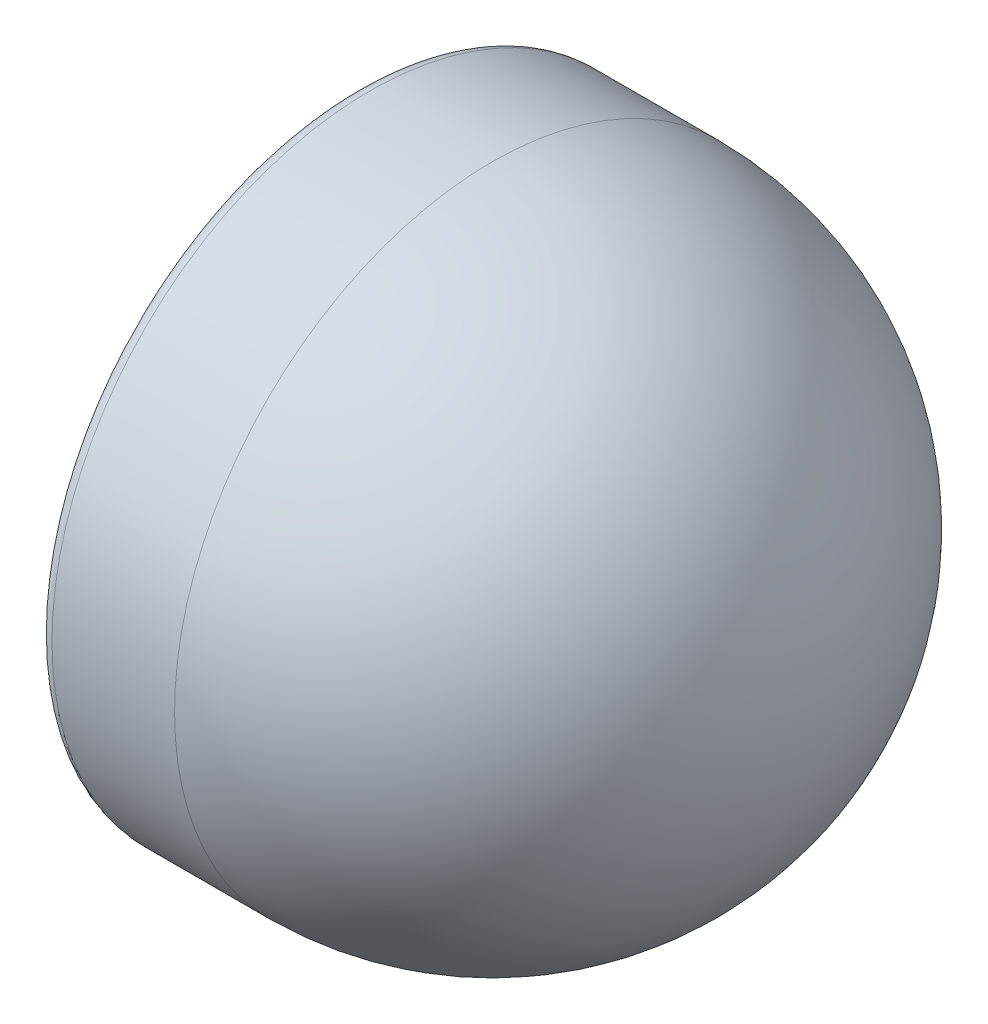
ISO-10303-21;
HEADER;
FILE_DESCRIPTION(('STEP AP214'),'2;1');
FILE_NAME('part.step','',(''),(''),'','','');
FILE_SCHEMA(('AUTOMOTIVE_DESIGN { 1 0 10303 214 1 1 1 1 }'));
ENDSEC;
DATA;
#1=APPLICATION_CONTEXT('core data for automotive mechanical design processes');
#2=APPLICATION_PROTOCOL_DEFINITION('international standard','automotive_design',2000,#1);
#3=PRODUCT_CONTEXT('',#1,'mechanical');
#4=PRODUCT('Part','Part','',(#3));
#5=PRODUCT_RELATED_PRODUCT_CATEGORY('part','',(#4));
#6=PRODUCT_DEFINITION_FORMATION('','',#4);
#7=PRODUCT_DEFINITION_CONTEXT('part definition',#1,'design');
#8=PRODUCT_DEFINITION('design','',#6,#7);
#9=PRODUCT_DEFINITION_SHAPE('','',#8);
#10=(LENGTH_UNIT() NAMED_UNIT(*) SI_UNIT(.MILLI.,.METRE.));
#11=(NAMED_UNIT(*) PLANE_ANGLE_UNIT() SI_UNIT($,.RADIAN.));
#12=(NAMED_UNIT(*) SI_UNIT($,.STERADIAN.) SOLID_ANGLE_UNIT());
#13=UNCERTAINTY_MEASURE_WITH_UNIT(LENGTH_MEASURE(1.E-05),#10,'distance_accuracy_value','');
#14=(GEOMETRIC_REPRESENTATION_CONTEXT(3) GLOBAL_UNCERTAINTY_ASSIGNED_CONTEXT((#13)) GLOBAL_UNIT_ASSIGNED_CONTEXT((#10,
#11,#12)) REPRESENTATION_CONTEXT('',''));
#15=CARTESIAN_POINT('',(0.,0.,0.));
#16=DIRECTION('',(0.,0.,1.));
#17=DIRECTION('',(1.,0.,0.));
#18=AXIS2_PLACEMENT_3D('',#15,#16,#17);
#19=CARTESIAN_POINT('',(-70.,0.,0.));
#20=DIRECTION('',(-1.,0.,0.));
#21=DIRECTION('',(0.,1.,0.));
#22=AXIS2_PLACEMENT_3D('',#19,#20,#21);
#23=SPHERICAL_SURFACE('',#22,70.);
#24=CARTESIAN_POINT('',(-70.,0.,0.));
#25=DIRECTION('',(-1.,0.,0.));
#26=DIRECTION('',(0.,0.,1.));
#27=AXIS2_PLACEMENT_3D('',#24,#25,#26);
#28=CIRCLE('',#27,70.);
#29=CARTESIAN_POINT('',(-70.,0.,70.));
#30=VERTEX_POINT('',#29);
#31=EDGE_CURVE('E10',#30,#30,#28,.T.);
#32=ORIENTED_EDGE('',*,*,#31,.F.);
#33=EDGE_LOOP('',(#32));
#34=FACE_BOUND('',#33,.T.);
#35=ADVANCED_FACE('F37',(#34),#23,.T.);
#36=CARTESIAN_POINT('',(-1.,0.,0.));
#37=DIRECTION('',(-1.,0.,0.));
#38=DIRECTION('',(0.,0.,1.));
#39=AXIS2_PLACEMENT_3D('',#36,#37,#38);
#40=CYLINDRICAL_SURFACE('',#39,70.);
#41=CARTESIAN_POINT('',(-97.,0.,0.));
#42=DIRECTION('',(-1.,0.,0.));
#43=DIRECTION('',(0.,0.,1.));
#44=AXIS2_PLACEMENT_3D('',#41,#42,#43);
#45=CIRCLE('',#44,70.);
#46=CARTESIAN_POINT('',(-97.,0.,70.));
#47=VERTEX_POINT('',#46);
#48=EDGE_CURVE('E44',#47,#47,#45,.T.);
#49=ORIENTED_EDGE('',*,*,#48,.F.);
#50=EDGE_LOOP('',(#49));
#51=FACE_BOUND('',#50,.T.);
#52=ORIENTED_EDGE('',*,*,#31,.T.);
#53=EDGE_LOOP('',(#52));
#54=FACE_BOUND('',#53,.T.);
#55=ADVANCED_FACE('F201',(#51,#54),#40,.T.);
#56=CARTESIAN_POINT('',(-97.,0.,0.));
#57=DIRECTION('',(-1.,0.,0.));
#58=DIRECTION('',(0.,0.,1.));
#59=AXIS2_PLACEMENT_3D('',#56,#57,#58);
#60=TOROIDAL_SURFACE('',#59,67.,3.);
#61=CARTESIAN_POINT('',(-100.,0.,0.));
#62=DIRECTION('',(-1.,0.,0.));
#63=DIRECTION('',(0.,0.,1.));
#64=AXIS2_PLACEMENT_3D('',#61,#62,#63);
#65=CIRCLE('',#64,67.);
#66=CARTESIAN_POINT('',(-100.,0.,67.));
#67=VERTEX_POINT('',#66);
#68=EDGE_CURVE('E49',#67,#67,#65,.T.);
#69=ORIENTED_EDGE('',*,*,#68,.F.);
#70=EDGE_LOOP('',(#69));
#71=FACE_BOUND('',#70,.T.);
#72=ORIENTED_EDGE('',*,*,#48,.T.);
#73=EDGE_LOOP('',(#72));
#74=FACE_BOUND('',#73,.T.);
#75=ADVANCED_FACE('F196',(#71,#74),#60,.T.);
#76=CARTESIAN_POINT('',(-100.,67.,0.));
#77=DIRECTION('',(1.,0.,0.));
#78=DIRECTION('',(0.,0.,-1.));
#79=AXIS2_PLACEMENT_3D('',#76,#77,#78);
#80=PLANE('',#79);
#81=CARTESIAN_POINT('',(-100.,0.,0.));
#82=DIRECTION('',(-1.,0.,0.));
#83=DIRECTION('',(0.,0.,1.));
#84=AXIS2_PLACEMENT_3D('',#81,#82,#83);
#85=CIRCLE('',#84,61.5);
#86=CARTESIAN_POINT('',(-100.,0.,61.5));
#87=VERTEX_POINT('',#86);
#88=EDGE_CURVE('E54',#87,#87,#85,.T.);
#89=ORIENTED_EDGE('',*,*,#88,.F.);
#90=EDGE_LOOP('',(#89));
#91=FACE_BOUND('',#90,.T.);
#92=ORIENTED_EDGE('',*,*,#68,.T.);
#93=EDGE_LOOP('',(#92));
#94=FACE_BOUND('',#93,.T.);
#95=ADVANCED_FACE('F190',(#91,#94),#80,.F.);
#96=CARTESIAN_POINT('',(-98.5,0.,0.));
#97=DIRECTION('',(-1.,0.,0.));
#98=DIRECTION('',(0.,0.,1.));
#99=AXIS2_PLACEMENT_3D('',#96,#97,#98);
#100=TOROIDAL_SURFACE('',#99,61.5,1.5);
#101=CARTESIAN_POINT('',(-98.5,0.,0.));
#102=DIRECTION('',(-1.,0.,0.));
#103=DIRECTION('',(0.,0.,1.));
#104=AXIS2_PLACEMENT_3D('',#101,#102,#103);
#105=CIRCLE('',#104,60.);
#106=CARTESIAN_POINT('',(-98.5,0.,60.));
#107=VERTEX_POINT('',#106);
#108=EDGE_CURVE('E60',#107,#107,#105,.T.);
#109=ORIENTED_EDGE('',*,*,#108,.F.);
#110=EDGE_LOOP('',(#109));
#111=FACE_BOUND('',#110,.T.);
#112=ORIENTED_EDGE('',*,*,#88,.T.);
#113=EDGE_LOOP('',(#112));
#114=FACE_BOUND('',#113,.T.);
#115=ADVANCED_FACE('F184',(#111,#114),#100,.T.);
#116=CARTESIAN_POINT('',(-1.,0.,0.));
#117=DIRECTION('',(-1.,0.,0.));
#118=DIRECTION('',(0.,0.,1.));
#119=AXIS2_PLACEMENT_3D('',#116,#117,#118);
#120=CYLINDRICAL_SURFACE('',#119,60.);
#121=CARTESIAN_POINT('',(-96.6213203435597,0.,0.));
#122=DIRECTION('',(-1.,0.,0.));
#123=DIRECTION('',(0.,0.,1.));
#124=AXIS2_PLACEMENT_3D('',#121,#122,#123);
#125=CIRCLE('',#124,60.);
#126=CARTESIAN_POINT('',(-96.6213203435597,0.,60.));
#127=VERTEX_POINT('',#126);
#128=EDGE_CURVE('E64',#127,#127,#125,.T.);
#129=ORIENTED_EDGE('',*,*,#128,.F.);
#130=EDGE_LOOP('',(#129));
#131=FACE_BOUND('',#130,.T.);
#132=ORIENTED_EDGE('',*,*,#108,.T.);
#133=EDGE_LOOP('',(#132));
#134=FACE_BOUND('',#133,.T.);
#135=ADVANCED_FACE('F178',(#131,#134),#120,.F.);
#136=CARTESIAN_POINT('',(-96.6213203435597,0.,0.));
#137=DIRECTION('',(-1.,0.,0.));
#138=DIRECTION('',(0.,0.,1.));
#139=AXIS2_PLACEMENT_3D('',#136,#137,#138);
#140=TOROIDAL_SURFACE('',#139,61.5,1.5);
#141=CARTESIAN_POINT('',(-95.5606601717798,0.,0.));
#142=DIRECTION('',(-1.,0.,0.));
#143=DIRECTION('',(0.,0.,1.));
#144=AXIS2_PLACEMENT_3D('',#141,#142,#143);
#145=CIRCLE('',#144,60.4393398282202);
#146=CARTESIAN_POINT('',(-95.5606601717798,0.,60.4393398282202));
#147=VERTEX_POINT('',#146);
#148=EDGE_CURVE('E68',#147,#147,#145,.T.);
#149=ORIENTED_EDGE('',*,*,#148,.F.);
#150=EDGE_LOOP('',(#149));
#151=FACE_BOUND('',#150,.T.);
#152=ORIENTED_EDGE('',*,*,#128,.T.);
#153=EDGE_LOOP('',(#152));
#154=FACE_BOUND('',#153,.T.);
#155=ADVANCED_FACE('F172',(#151,#154),#140,.T.);
#156=CARTESIAN_POINT('',(-95.5606601717798,0.,0.));
#157=DIRECTION('',(1.,0.,0.));
#158=DIRECTION('',(0.,0.,-1.));
#159=AXIS2_PLACEMENT_3D('',#156,#157,#158);
#160=CONICAL_SURFACE('',#159,60.4393398282202,0.785398163397447);
#161=CARTESIAN_POINT('',(-92.0009060725429,0.,0.));
#162=DIRECTION('',(-1.,0.,0.));
#163=DIRECTION('',(0.,0.,1.));
#164=AXIS2_PLACEMENT_3D('',#161,#162,#163);
#165=CIRCLE('',#164,63.9990939274571);
#166=CARTESIAN_POINT('',(-92.0009060725429,0.,63.9990939274571));
#167=VERTEX_POINT('',#166);
#168=EDGE_CURVE('E72',#167,#167,#165,.T.);
#169=ORIENTED_EDGE('',*,*,#168,.F.);
#170=EDGE_LOOP('',(#169));
#171=FACE_BOUND('',#170,.T.);
#172=ORIENTED_EDGE('',*,*,#148,.T.);
#173=EDGE_LOOP('',(#172));
#174=FACE_BOUND('',#173,.T.);
#175=ADVANCED_FACE('F166',(#171,#174),#160,.F.);
#176=CARTESIAN_POINT('',(-92.0009060725429,63.9990939274571,0.));
#177=DIRECTION('',(-1.,0.,0.));
#178=DIRECTION('',(0.,0.,1.));
#179=AXIS2_PLACEMENT_3D('',#176,#177,#178);
#180=PLANE('',#179);
#181=CARTESIAN_POINT('',(-92.0009060725429,0.,0.));
#182=DIRECTION('',(-1.,0.,0.));
#183=DIRECTION('',(0.,0.,1.));
#184=AXIS2_PLACEMENT_3D('',#181,#182,#183);
#185=CIRCLE('',#184,64.7062007086437);
#186=CARTESIAN_POINT('',(-92.0009060725429,0.,64.7062007086437));
#187=VERTEX_POINT('',#186);
#188=EDGE_CURVE('E76',#187,#187,#185,.T.);
#189=ORIENTED_EDGE('',*,*,#188,.F.);
#190=EDGE_LOOP('',(#189));
#191=FACE_BOUND('',#190,.T.);
#192=ORIENTED_EDGE('',*,*,#168,.T.);
#193=EDGE_LOOP('',(#192));
#194=FACE_BOUND('',#193,.T.);
#195=ADVANCED_FACE('F160',(#191,#194),#180,.F.);
#196=CARTESIAN_POINT('',(-1.,0.,0.));
#197=DIRECTION('',(-1.,0.,0.));
#198=DIRECTION('',(0.,0.,1.));
#199=AXIS2_PLACEMENT_3D('',#196,#197,#198);
#200=CYLINDRICAL_SURFACE('',#199,64.7062007086437);
#201=CARTESIAN_POINT('',(-92.7080128537294,0.,0.));
#202=DIRECTION('',(-1.,0.,0.));
#203=DIRECTION('',(0.,0.,1.));
#204=AXIS2_PLACEMENT_3D('',#201,#202,#203);
#205=CIRCLE('',#204,64.7062007086437);
#206=CARTESIAN_POINT('',(-92.7080128537294,0.,64.7062007086437));
#207=VERTEX_POINT('',#206);
#208=EDGE_CURVE('E80',#207,#207,#205,.T.);
#209=ORIENTED_EDGE('',*,*,#208,.F.);
#210=EDGE_LOOP('',(#209));
#211=FACE_BOUND('',#210,.T.);
#212=ORIENTED_EDGE('',*,*,#188,.T.);
#213=EDGE_LOOP('',(#212));
#214=FACE_BOUND('',#213,.T.);
#215=ADVANCED_FACE('F154',(#211,#214),#200,.T.);
#216=CARTESIAN_POINT('',(-92.7080128537294,0.,0.));
#217=DIRECTION('',(1.,0.,0.));
#218=DIRECTION('',(0.,0.,-1.));
#219=AXIS2_PLACEMENT_3D('',#216,#217,#218);
#220=CONICAL_SURFACE('',#219,64.7062007086437,0.785398163397445);
#221=CARTESIAN_POINT('',(-96.2677669529664,0.,0.));
#222=DIRECTION('',(-1.,0.,0.));
#223=DIRECTION('',(0.,0.,1.));
#224=AXIS2_PLACEMENT_3D('',#221,#222,#223);
#225=CIRCLE('',#224,61.1464466094067);
#226=CARTESIAN_POINT('',(-96.2677669529664,0.,61.1464466094067));
#227=VERTEX_POINT('',#226);
#228=EDGE_CURVE('E84',#227,#227,#225,.T.);
#229=ORIENTED_EDGE('',*,*,#228,.F.);
#230=EDGE_LOOP('',(#229));
#231=FACE_BOUND('',#230,.T.);
#232=ORIENTED_EDGE('',*,*,#208,.T.);
#233=EDGE_LOOP('',(#232));
#234=FACE_BOUND('',#233,.T.);
#235=ADVANCED_FACE('F148',(#231,#234),#220,.T.);
#236=CARTESIAN_POINT('',(-96.6213203435597,0.,0.));
#237=DIRECTION('',(-1.,0.,0.));
#238=DIRECTION('',(0.,0.,1.));
#239=AXIS2_PLACEMENT_3D('',#236,#237,#238);
#240=TOROIDAL_SURFACE('',#239,61.5,0.499999999999999);
#241=CARTESIAN_POINT('',(-96.6213203435597,0.,0.));
#242=DIRECTION('',(-1.,0.,0.));
#243=DIRECTION('',(0.,0.,1.));
#244=AXIS2_PLACEMENT_3D('',#241,#242,#243);
#245=CIRCLE('',#244,61.);
#246=CARTESIAN_POINT('',(-96.6213203435597,0.,61.));
#247=VERTEX_POINT('',#246);
#248=EDGE_CURVE('E88',#247,#247,#245,.T.);
#249=ORIENTED_EDGE('',*,*,#248,.F.);
#250=EDGE_LOOP('',(#249));
#251=FACE_BOUND('',#250,.T.);
#252=ORIENTED_EDGE('',*,*,#228,.T.);
#253=EDGE_LOOP('',(#252));
#254=FACE_BOUND('',#253,.T.);
#255=ADVANCED_FACE('F142',(#251,#254),#240,.F.);
#256=CARTESIAN_POINT('',(-1.,0.,0.));
#257=DIRECTION('',(-1.,0.,0.));
#258=DIRECTION('',(0.,0.,1.));
#259=AXIS2_PLACEMENT_3D('',#256,#257,#258);
#260=CYLINDRICAL_SURFACE('',#259,61.);
#261=CARTESIAN_POINT('',(-98.5,0.,0.));
#262=DIRECTION('',(-1.,0.,0.));
#263=DIRECTION('',(0.,0.,1.));
#264=AXIS2_PLACEMENT_3D('',#261,#262,#263);
#265=CIRCLE('',#264,61.);
#266=CARTESIAN_POINT('',(-98.5,0.,61.));
#267=VERTEX_POINT('',#266);
#268=EDGE_CURVE('E92',#267,#267,#265,.T.);
#269=ORIENTED_EDGE('',*,*,#268,.F.);
#270=EDGE_LOOP('',(#269));
#271=FACE_BOUND('',#270,.T.);
#272=ORIENTED_EDGE('',*,*,#248,.T.);
#273=EDGE_LOOP('',(#272));
#274=FACE_BOUND('',#273,.T.);
#275=ADVANCED_FACE('F136',(#271,#274),#260,.T.);
#276=CARTESIAN_POINT('',(-98.5,0.,0.));
#277=DIRECTION('',(-1.,0.,0.));
#278=DIRECTION('',(0.,0.,1.));
#279=AXIS2_PLACEMENT_3D('',#276,#277,#278);
#280=TOROIDAL_SURFACE('',#279,61.5,0.5);
#281=CARTESIAN_POINT('',(-99.,0.,0.));
#282=DIRECTION('',(-1.,0.,0.));
#283=DIRECTION('',(0.,0.,1.));
#284=AXIS2_PLACEMENT_3D('',#281,#282,#283);
#285=CIRCLE('',#284,61.5);
#286=CARTESIAN_POINT('',(-99.,0.,61.5));
#287=VERTEX_POINT('',#286);
#288=EDGE_CURVE('E96',#287,#287,#285,.T.);
#289=ORIENTED_EDGE('',*,*,#288,.F.);
#290=EDGE_LOOP('',(#289));
#291=FACE_BOUND('',#290,.T.);
#292=ORIENTED_EDGE('',*,*,#268,.T.);
#293=EDGE_LOOP('',(#292));
#294=FACE_BOUND('',#293,.T.);
#295=ADVANCED_FACE('F130',(#291,#294),#280,.F.);
#296=CARTESIAN_POINT('',(-99.,67.,0.));
#297=DIRECTION('',(-1.,0.,0.));
#298=DIRECTION('',(0.,0.,1.));
#299=AXIS2_PLACEMENT_3D('',#296,#297,#298);
#300=PLANE('',#299);
#301=CARTESIAN_POINT('',(-99.,0.,0.));
#302=DIRECTION('',(-1.,0.,0.));
#303=DIRECTION('',(0.,0.,1.));
#304=AXIS2_PLACEMENT_3D('',#301,#302,#303);
#305=CIRCLE('',#304,67.);
#306=CARTESIAN_POINT('',(-99.,0.,67.));
#307=VERTEX_POINT('',#306);
#308=EDGE_CURVE('E100',#307,#307,#305,.T.);
#309=ORIENTED_EDGE('',*,*,#308,.F.);
#310=EDGE_LOOP('',(#309));
#311=FACE_BOUND('',#310,.T.);
#312=ORIENTED_EDGE('',*,*,#288,.T.);
#313=EDGE_LOOP('',(#312));
#314=FACE_BOUND('',#313,.T.);
#315=ADVANCED_FACE('F124',(#311,#314),#300,.F.);
#316=CARTESIAN_POINT('',(-97.,0.,0.));
#317=DIRECTION('',(-1.,0.,0.));
#318=DIRECTION('',(0.,0.,1.));
#319=AXIS2_PLACEMENT_3D('',#316,#317,#318);
#320=TOROIDAL_SURFACE('',#319,67.,2.);
#321=CARTESIAN_POINT('',(-97.,0.,0.));
#322=DIRECTION('',(-1.,0.,0.));
#323=DIRECTION('',(0.,0.,1.));
#324=AXIS2_PLACEMENT_3D('',#321,#322,#323);
#325=CIRCLE('',#324,69.);
#326=CARTESIAN_POINT('',(-97.,0.,69.));
#327=VERTEX_POINT('',#326);
#328=EDGE_CURVE('E104',#327,#327,#325,.T.);
#329=ORIENTED_EDGE('',*,*,#328,.F.);
#330=EDGE_LOOP('',(#329));
#331=FACE_BOUND('',#330,.T.);
#332=ORIENTED_EDGE('',*,*,#308,.T.);
#333=EDGE_LOOP('',(#332));
#334=FACE_BOUND('',#333,.T.);
#335=ADVANCED_FACE('F118',(#331,#334),#320,.F.);
#336=CARTESIAN_POINT('',(-1.,0.,0.));
#337=DIRECTION('',(-1.,0.,0.));
#338=DIRECTION('',(0.,0.,1.));
#339=AXIS2_PLACEMENT_3D('',#336,#337,#338);
#340=CYLINDRICAL_SURFACE('',#339,69.);
#341=CARTESIAN_POINT('',(-70.,0.,0.));
#342=DIRECTION('',(-1.,0.,0.));
#343=DIRECTION('',(0.,0.,1.));
#344=AXIS2_PLACEMENT_3D('',#341,#342,#343);
#345=CIRCLE('',#344,69.);
#346=CARTESIAN_POINT('',(-70.,0.,69.));
#347=VERTEX_POINT('',#346);
#348=EDGE_CURVE('E108',#347,#347,#345,.T.);
#349=ORIENTED_EDGE('',*,*,#348,.F.);
#350=EDGE_LOOP('',(#349));
#351=FACE_BOUND('',#350,.T.);
#352=ORIENTED_EDGE('',*,*,#328,.T.);
#353=EDGE_LOOP('',(#352));
#354=FACE_BOUND('',#353,.T.);
#355=ADVANCED_FACE('F115',(#351,#354),#340,.F.);
#356=CARTESIAN_POINT('',(-70.,0.,0.));
#357=DIRECTION('',(-1.,0.,0.));
#358=DIRECTION('',(0.,1.,0.));
#359=AXIS2_PLACEMENT_3D('',#356,#357,#358);
#360=SPHERICAL_SURFACE('',#359,69.);
#361=ORIENTED_EDGE('',*,*,#348,.T.);
#362=EDGE_LOOP('',(#361));
#363=FACE_BOUND('',#362,.T.);
#364=ADVANCED_FACE('F113',(#363),#360,.F.);
#365=CLOSED_SHELL('',(#35,#55,#75,#95,#115,#135,#155,#175,#195,#215,#235,#255,#275,#295,#315,
#335,#355,#364));
#366=MANIFOLD_SOLID_BREP('B2',#365);
#367=ADVANCED_BREP_SHAPE_REPRESENTATION('',(#18,#366),#14);
#368=SHAPE_DEFINITION_REPRESENTATION(#9,#367);
ENDSEC;
END-ISO-10303-21;
